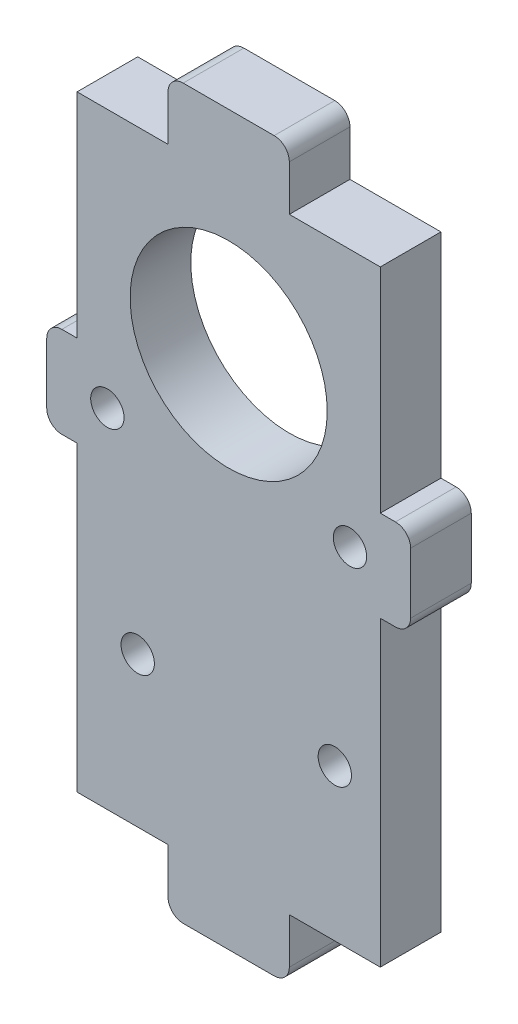
ISO-10303-21;
HEADER;
FILE_DESCRIPTION(('STEP AP214'),'2;1');
FILE_NAME('part.step','',(''),(''),'','','');
FILE_SCHEMA(('AUTOMOTIVE_DESIGN { 1 0 10303 214 1 1 1 1 }'));
ENDSEC;
DATA;
#1=APPLICATION_CONTEXT('core data for automotive mechanical design processes');
#2=APPLICATION_PROTOCOL_DEFINITION('international standard','automotive_design',2000,#1);
#3=PRODUCT_CONTEXT('',#1,'mechanical');
#4=PRODUCT('Part','Part','',(#3));
#5=PRODUCT_RELATED_PRODUCT_CATEGORY('part','',(#4));
#6=PRODUCT_DEFINITION_FORMATION('','',#4);
#7=PRODUCT_DEFINITION_CONTEXT('part definition',#1,'design');
#8=PRODUCT_DEFINITION('design','',#6,#7);
#9=PRODUCT_DEFINITION_SHAPE('','',#8);
#10=(LENGTH_UNIT() NAMED_UNIT(*) SI_UNIT(.MILLI.,.METRE.));
#11=(NAMED_UNIT(*) PLANE_ANGLE_UNIT() SI_UNIT($,.RADIAN.));
#12=(NAMED_UNIT(*) SI_UNIT($,.STERADIAN.) SOLID_ANGLE_UNIT());
#13=UNCERTAINTY_MEASURE_WITH_UNIT(LENGTH_MEASURE(1.E-05),#10,'distance_accuracy_value','');
#14=(GEOMETRIC_REPRESENTATION_CONTEXT(3) GLOBAL_UNCERTAINTY_ASSIGNED_CONTEXT((#13)) GLOBAL_UNIT_ASSIGNED_CONTEXT((#10,
#11,#12)) REPRESENTATION_CONTEXT('',''));
#15=CARTESIAN_POINT('',(0.,0.,0.));
#16=DIRECTION('',(0.,0.,1.));
#17=DIRECTION('',(1.,0.,0.));
#18=AXIS2_PLACEMENT_3D('',#15,#16,#17);
#19=CARTESIAN_POINT('',(9.99999999999999,0.,4.));
#20=DIRECTION('',(1.,0.,0.));
#21=DIRECTION('',(0.,1.,0.));
#22=AXIS2_PLACEMENT_3D('',#19,#20,#21);
#23=PLANE('',#22);
#24=DIRECTION('',(0.,-1.,0.));
#25=VECTOR('',#24,1.);
#26=CARTESIAN_POINT('',(9.99999999999999,0.,0.));
#27=LINE('',#26,#25);
#28=CARTESIAN_POINT('',(9.99999999999999,20.,0.));
#29=VERTEX_POINT('',#28);
#30=CARTESIAN_POINT('',(9.99999999999999,5.9336621800509,0.));
#31=VERTEX_POINT('',#30);
#32=EDGE_CURVE('E264',#29,#31,#27,.T.);
#33=ORIENTED_EDGE('',*,*,#32,.F.);
#34=DIRECTION('',(0.,0.,-1.));
#35=VECTOR('',#34,1.);
#36=CARTESIAN_POINT('',(9.99999999999999,20.,4.));
#37=LINE('',#36,#35);
#38=CARTESIAN_POINT('',(9.99999999999999,20.,4.));
#39=VERTEX_POINT('',#38);
#40=EDGE_CURVE('E11',#39,#29,#37,.T.);
#41=ORIENTED_EDGE('',*,*,#40,.F.);
#42=DIRECTION('',(0.,-1.,0.));
#43=VECTOR('',#42,1.);
#44=CARTESIAN_POINT('',(9.99999999999999,0.,4.));
#45=LINE('',#44,#43);
#46=CARTESIAN_POINT('',(9.99999999999999,5.9336621800509,4.));
#47=VERTEX_POINT('',#46);
#48=EDGE_CURVE('E575',#39,#47,#45,.T.);
#49=ORIENTED_EDGE('',*,*,#48,.T.);
#50=DIRECTION('',(0.,0.,-1.));
#51=VECTOR('',#50,1.);
#52=CARTESIAN_POINT('',(9.99999999999999,5.9336621800509,4.));
#53=LINE('',#52,#51);
#54=EDGE_CURVE('E53',#47,#31,#53,.T.);
#55=ORIENTED_EDGE('',*,*,#54,.T.);
#56=EDGE_LOOP('',(#33,#41,#49,#55));
#57=FACE_BOUND('',#56,.T.);
#58=ADVANCED_FACE('F36',(#57),#23,.T.);
#59=CARTESIAN_POINT('',(0.,20.,4.));
#60=DIRECTION('',(0.,1.,0.));
#61=DIRECTION('',(-1.,0.,0.));
#62=AXIS2_PLACEMENT_3D('',#59,#60,#61);
#63=PLANE('',#62);
#64=DIRECTION('',(1.,0.,0.));
#65=VECTOR('',#64,1.);
#66=CARTESIAN_POINT('',(0.,20.,0.));
#67=LINE('',#66,#65);
#68=CARTESIAN_POINT('',(4.,20.,0.));
#69=VERTEX_POINT('',#68);
#70=EDGE_CURVE('E266',#69,#29,#67,.T.);
#71=ORIENTED_EDGE('',*,*,#70,.F.);
#72=DIRECTION('',(0.,0.,-1.));
#73=VECTOR('',#72,1.);
#74=CARTESIAN_POINT('',(4.,20.,4.));
#75=LINE('',#74,#73);
#76=CARTESIAN_POINT('',(4.,20.,4.));
#77=VERTEX_POINT('',#76);
#78=EDGE_CURVE('E45',#77,#69,#75,.T.);
#79=ORIENTED_EDGE('',*,*,#78,.F.);
#80=DIRECTION('',(1.,0.,0.));
#81=VECTOR('',#80,1.);
#82=CARTESIAN_POINT('',(0.,20.,4.));
#83=LINE('',#82,#81);
#84=EDGE_CURVE('E406',#77,#39,#83,.T.);
#85=ORIENTED_EDGE('',*,*,#84,.T.);
#86=ORIENTED_EDGE('',*,*,#40,.T.);
#87=EDGE_LOOP('',(#71,#79,#85,#86));
#88=FACE_BOUND('',#87,.T.);
#89=ADVANCED_FACE('F405',(#88),#63,.T.);
#90=CARTESIAN_POINT('',(4.,0.,4.));
#91=DIRECTION('',(-1.,0.,0.));
#92=DIRECTION('',(0.,0.,1.));
#93=AXIS2_PLACEMENT_3D('',#90,#91,#92);
#94=PLANE('',#93);
#95=DIRECTION('',(0.,1.,0.));
#96=VECTOR('',#95,1.);
#97=CARTESIAN_POINT('',(4.,0.,0.));
#98=LINE('',#97,#96);
#99=CARTESIAN_POINT('',(4.,23.,0.));
#100=VERTEX_POINT('',#99);
#101=EDGE_CURVE('E270',#69,#100,#98,.T.);
#102=ORIENTED_EDGE('',*,*,#101,.T.);
#103=DIRECTION('',(0.,0.,-1.));
#104=VECTOR('',#103,1.);
#105=CARTESIAN_POINT('',(4.,23.,4.));
#106=LINE('',#105,#104);
#107=CARTESIAN_POINT('',(4.,23.,4.));
#108=VERTEX_POINT('',#107);
#109=EDGE_CURVE('E391',#108,#100,#106,.T.);
#110=ORIENTED_EDGE('',*,*,#109,.F.);
#111=DIRECTION('',(0.,1.,0.));
#112=VECTOR('',#111,1.);
#113=CARTESIAN_POINT('',(4.,0.,4.));
#114=LINE('',#113,#112);
#115=EDGE_CURVE('E397',#77,#108,#114,.T.);
#116=ORIENTED_EDGE('',*,*,#115,.F.);
#117=ORIENTED_EDGE('',*,*,#78,.T.);
#118=EDGE_LOOP('',(#102,#110,#116,#117));
#119=FACE_BOUND('',#118,.T.);
#120=ADVANCED_FACE('F395',(#119),#94,.F.);
#121=CARTESIAN_POINT('',(3.,23.,4.));
#122=DIRECTION('',(0.,0.,-1.));
#123=DIRECTION('',(-1.,0.,0.));
#124=AXIS2_PLACEMENT_3D('',#121,#122,#123);
#125=CYLINDRICAL_SURFACE('',#124,1.);
#126=CARTESIAN_POINT('',(3.,23.,0.));
#127=DIRECTION('',(0.,0.,1.));
#128=DIRECTION('',(1.,0.,0.));
#129=AXIS2_PLACEMENT_3D('',#126,#127,#128);
#130=CIRCLE('',#129,1.);
#131=CARTESIAN_POINT('',(3.,24.,0.));
#132=VERTEX_POINT('',#131);
#133=EDGE_CURVE('E274',#132,#100,#130,.F.);
#134=ORIENTED_EDGE('',*,*,#133,.F.);
#135=DIRECTION('',(0.,0.,-1.));
#136=VECTOR('',#135,1.);
#137=CARTESIAN_POINT('',(3.,24.,4.));
#138=LINE('',#137,#136);
#139=CARTESIAN_POINT('',(3.,24.,4.));
#140=VERTEX_POINT('',#139);
#141=EDGE_CURVE('E389',#140,#132,#138,.T.);
#142=ORIENTED_EDGE('',*,*,#141,.F.);
#143=CARTESIAN_POINT('',(3.,23.,4.));
#144=DIRECTION('',(0.,0.,1.));
#145=DIRECTION('',(1.,0.,0.));
#146=AXIS2_PLACEMENT_3D('',#143,#144,#145);
#147=CIRCLE('',#146,1.);
#148=EDGE_CURVE('E546',#140,#108,#147,.F.);
#149=ORIENTED_EDGE('',*,*,#148,.T.);
#150=ORIENTED_EDGE('',*,*,#109,.T.);
#151=EDGE_LOOP('',(#134,#142,#149,#150));
#152=FACE_BOUND('',#151,.T.);
#153=ADVANCED_FACE('F545',(#152),#125,.T.);
#154=CARTESIAN_POINT('',(0.,24.,4.));
#155=DIRECTION('',(0.,1.,0.));
#156=DIRECTION('',(0.,0.,1.));
#157=AXIS2_PLACEMENT_3D('',#154,#155,#156);
#158=PLANE('',#157);
#159=DIRECTION('',(1.,0.,0.));
#160=VECTOR('',#159,1.);
#161=CARTESIAN_POINT('',(0.,24.,0.));
#162=LINE('',#161,#160);
#163=CARTESIAN_POINT('',(-3.,24.,0.));
#164=VERTEX_POINT('',#163);
#165=EDGE_CURVE('E277',#164,#132,#162,.T.);
#166=ORIENTED_EDGE('',*,*,#165,.F.);
#167=DIRECTION('',(0.,0.,-1.));
#168=VECTOR('',#167,1.);
#169=CARTESIAN_POINT('',(-3.,24.,4.));
#170=LINE('',#169,#168);
#171=CARTESIAN_POINT('',(-3.,24.,4.));
#172=VERTEX_POINT('',#171);
#173=EDGE_CURVE('E387',#172,#164,#170,.T.);
#174=ORIENTED_EDGE('',*,*,#173,.F.);
#175=DIRECTION('',(1.,0.,0.));
#176=VECTOR('',#175,1.);
#177=CARTESIAN_POINT('',(0.,24.,4.));
#178=LINE('',#177,#176);
#179=EDGE_CURVE('E541',#172,#140,#178,.T.);
#180=ORIENTED_EDGE('',*,*,#179,.T.);
#181=ORIENTED_EDGE('',*,*,#141,.T.);
#182=EDGE_LOOP('',(#166,#174,#180,#181));
#183=FACE_BOUND('',#182,.T.);
#184=ADVANCED_FACE('F540',(#183),#158,.T.);
#185=CARTESIAN_POINT('',(-3.,23.,4.));
#186=DIRECTION('',(0.,0.,-1.));
#187=DIRECTION('',(-1.,0.,0.));
#188=AXIS2_PLACEMENT_3D('',#185,#186,#187);
#189=CYLINDRICAL_SURFACE('',#188,1.);
#190=CARTESIAN_POINT('',(-3.,23.,0.));
#191=DIRECTION('',(0.,0.,1.));
#192=DIRECTION('',(1.,0.,0.));
#193=AXIS2_PLACEMENT_3D('',#190,#191,#192);
#194=CIRCLE('',#193,1.);
#195=CARTESIAN_POINT('',(-4.,23.,0.));
#196=VERTEX_POINT('',#195);
#197=EDGE_CURVE('E280',#196,#164,#194,.F.);
#198=ORIENTED_EDGE('',*,*,#197,.F.);
#199=DIRECTION('',(0.,0.,-1.));
#200=VECTOR('',#199,1.);
#201=CARTESIAN_POINT('',(-4.,23.,4.));
#202=LINE('',#201,#200);
#203=CARTESIAN_POINT('',(-4.,23.,4.));
#204=VERTEX_POINT('',#203);
#205=EDGE_CURVE('E385',#204,#196,#202,.T.);
#206=ORIENTED_EDGE('',*,*,#205,.F.);
#207=CARTESIAN_POINT('',(-3.,23.,4.));
#208=DIRECTION('',(0.,0.,1.));
#209=DIRECTION('',(1.,0.,0.));
#210=AXIS2_PLACEMENT_3D('',#207,#208,#209);
#211=CIRCLE('',#210,1.);
#212=EDGE_CURVE('E536',#204,#172,#211,.F.);
#213=ORIENTED_EDGE('',*,*,#212,.T.);
#214=ORIENTED_EDGE('',*,*,#173,.T.);
#215=EDGE_LOOP('',(#198,#206,#213,#214));
#216=FACE_BOUND('',#215,.T.);
#217=ADVANCED_FACE('F534',(#216),#189,.T.);
#218=CARTESIAN_POINT('',(-4.,0.,4.));
#219=DIRECTION('',(-1.,0.,0.));
#220=DIRECTION('',(0.,0.,1.));
#221=AXIS2_PLACEMENT_3D('',#218,#219,#220);
#222=PLANE('',#221);
#223=DIRECTION('',(0.,1.,0.));
#224=VECTOR('',#223,1.);
#225=CARTESIAN_POINT('',(-4.,0.,0.));
#226=LINE('',#225,#224);
#227=CARTESIAN_POINT('',(-4.,20.,0.));
#228=VERTEX_POINT('',#227);
#229=EDGE_CURVE('E283',#228,#196,#226,.T.);
#230=ORIENTED_EDGE('',*,*,#229,.F.);
#231=DIRECTION('',(0.,0.,-1.));
#232=VECTOR('',#231,1.);
#233=CARTESIAN_POINT('',(-4.,20.,4.));
#234=LINE('',#233,#232);
#235=CARTESIAN_POINT('',(-4.,20.,4.));
#236=VERTEX_POINT('',#235);
#237=EDGE_CURVE('E383',#236,#228,#234,.T.);
#238=ORIENTED_EDGE('',*,*,#237,.F.);
#239=DIRECTION('',(0.,1.,0.));
#240=VECTOR('',#239,1.);
#241=CARTESIAN_POINT('',(-4.,0.,4.));
#242=LINE('',#241,#240);
#243=EDGE_CURVE('E530',#236,#204,#242,.T.);
#244=ORIENTED_EDGE('',*,*,#243,.T.);
#245=ORIENTED_EDGE('',*,*,#205,.T.);
#246=EDGE_LOOP('',(#230,#238,#244,#245));
#247=FACE_BOUND('',#246,.T.);
#248=ADVANCED_FACE('F527',(#247),#222,.T.);
#249=CARTESIAN_POINT('',(-10.,20.,0.));
#250=VERTEX_POINT('',#249);
#251=EDGE_CURVE('E271',#250,#228,#67,.T.);
#252=ORIENTED_EDGE('',*,*,#251,.F.);
#253=DIRECTION('',(0.,0.,-1.));
#254=VECTOR('',#253,1.);
#255=CARTESIAN_POINT('',(-10.,20.,4.));
#256=LINE('',#255,#254);
#257=CARTESIAN_POINT('',(-10.,20.,4.));
#258=VERTEX_POINT('',#257);
#259=EDGE_CURVE('E381',#258,#250,#256,.T.);
#260=ORIENTED_EDGE('',*,*,#259,.F.);
#261=EDGE_CURVE('E523',#258,#236,#83,.T.);
#262=ORIENTED_EDGE('',*,*,#261,.T.);
#263=ORIENTED_EDGE('',*,*,#237,.T.);
#264=EDGE_LOOP('',(#252,#260,#262,#263));
#265=FACE_BOUND('',#264,.T.);
#266=ADVANCED_FACE('F427',(#265),#63,.T.);
#267=CARTESIAN_POINT('',(-10.,0.,4.));
#268=DIRECTION('',(1.,0.,0.));
#269=DIRECTION('',(0.,1.,0.));
#270=AXIS2_PLACEMENT_3D('',#267,#268,#269);
#271=PLANE('',#270);
#272=DIRECTION('',(0.,-1.,0.));
#273=VECTOR('',#272,1.);
#274=CARTESIAN_POINT('',(-10.,0.,0.));
#275=LINE('',#274,#273);
#276=CARTESIAN_POINT('',(-10.,5.9336621800509,0.));
#277=VERTEX_POINT('',#276);
#278=EDGE_CURVE('E286',#250,#277,#275,.T.);
#279=ORIENTED_EDGE('',*,*,#278,.T.);
#280=DIRECTION('',(0.,0.,-1.));
#281=VECTOR('',#280,1.);
#282=CARTESIAN_POINT('',(-10.,5.9336621800509,4.));
#283=LINE('',#282,#281);
#284=CARTESIAN_POINT('',(-10.,5.9336621800509,4.));
#285=VERTEX_POINT('',#284);
#286=EDGE_CURVE('E378',#285,#277,#283,.T.);
#287=ORIENTED_EDGE('',*,*,#286,.F.);
#288=DIRECTION('',(0.,-1.,0.));
#289=VECTOR('',#288,1.);
#290=CARTESIAN_POINT('',(-10.,0.,4.));
#291=LINE('',#290,#289);
#292=EDGE_CURVE('E519',#258,#285,#291,.T.);
#293=ORIENTED_EDGE('',*,*,#292,.F.);
#294=ORIENTED_EDGE('',*,*,#259,.T.);
#295=EDGE_LOOP('',(#279,#287,#293,#294));
#296=FACE_BOUND('',#295,.T.);
#297=ADVANCED_FACE('F518',(#296),#271,.F.);
#298=CARTESIAN_POINT('',(0.,5.93366218005089,4.));
#299=DIRECTION('',(0.,-1.,0.));
#300=DIRECTION('',(1.,0.,0.));
#301=AXIS2_PLACEMENT_3D('',#298,#299,#300);
#302=PLANE('',#301);
#303=DIRECTION('',(-1.,0.,0.));
#304=VECTOR('',#303,1.);
#305=CARTESIAN_POINT('',(0.,5.93366218005089,0.));
#306=LINE('',#305,#304);
#307=CARTESIAN_POINT('',(-11.,5.93366218005091,0.));
#308=VERTEX_POINT('',#307);
#309=EDGE_CURVE('E289',#277,#308,#306,.T.);
#310=ORIENTED_EDGE('',*,*,#309,.T.);
#311=DIRECTION('',(0.,0.,-1.));
#312=VECTOR('',#311,1.);
#313=CARTESIAN_POINT('',(-11.,5.93366218005091,4.));
#314=LINE('',#313,#312);
#315=CARTESIAN_POINT('',(-11.,5.93366218005091,4.));
#316=VERTEX_POINT('',#315);
#317=EDGE_CURVE('E375',#316,#308,#314,.T.);
#318=ORIENTED_EDGE('',*,*,#317,.F.);
#319=DIRECTION('',(-1.,0.,0.));
#320=VECTOR('',#319,1.);
#321=CARTESIAN_POINT('',(0.,5.93366218005089,4.));
#322=LINE('',#321,#320);
#323=EDGE_CURVE('E514',#285,#316,#322,.T.);
#324=ORIENTED_EDGE('',*,*,#323,.F.);
#325=ORIENTED_EDGE('',*,*,#286,.T.);
#326=EDGE_LOOP('',(#310,#318,#324,#325));
#327=FACE_BOUND('',#326,.T.);
#328=ADVANCED_FACE('F512',(#327),#302,.F.);
#329=CARTESIAN_POINT('',(-11.,4.93366218005091,4.));
#330=DIRECTION('',(0.,0.,-1.));
#331=DIRECTION('',(-1.,0.,0.));
#332=AXIS2_PLACEMENT_3D('',#329,#330,#331);
#333=CYLINDRICAL_SURFACE('',#332,1.);
#334=CARTESIAN_POINT('',(-11.,4.93366218005091,0.));
#335=DIRECTION('',(0.,0.,1.));
#336=DIRECTION('',(1.,0.,0.));
#337=AXIS2_PLACEMENT_3D('',#334,#335,#336);
#338=CIRCLE('',#337,1.);
#339=CARTESIAN_POINT('',(-12.,4.93366218005091,0.));
#340=VERTEX_POINT('',#339);
#341=EDGE_CURVE('E293',#308,#340,#338,.T.);
#342=ORIENTED_EDGE('',*,*,#341,.T.);
#343=DIRECTION('',(0.,0.,-1.));
#344=VECTOR('',#343,1.);
#345=CARTESIAN_POINT('',(-12.,4.93366218005091,4.));
#346=LINE('',#345,#344);
#347=CARTESIAN_POINT('',(-12.,4.93366218005091,4.));
#348=VERTEX_POINT('',#347);
#349=EDGE_CURVE('E372',#348,#340,#346,.T.);
#350=ORIENTED_EDGE('',*,*,#349,.F.);
#351=CARTESIAN_POINT('',(-11.,4.93366218005091,4.));
#352=DIRECTION('',(0.,0.,1.));
#353=DIRECTION('',(1.,0.,0.));
#354=AXIS2_PLACEMENT_3D('',#351,#352,#353);
#355=CIRCLE('',#354,1.);
#356=EDGE_CURVE('E556',#316,#348,#355,.T.);
#357=ORIENTED_EDGE('',*,*,#356,.F.);
#358=ORIENTED_EDGE('',*,*,#317,.T.);
#359=EDGE_LOOP('',(#342,#350,#357,#358));
#360=FACE_BOUND('',#359,.T.);
#361=ADVANCED_FACE('F505',(#360),#333,.T.);
#362=CARTESIAN_POINT('',(-12.,0.,4.));
#363=DIRECTION('',(1.,0.,0.));
#364=DIRECTION('',(0.,0.,-1.));
#365=AXIS2_PLACEMENT_3D('',#362,#363,#364);
#366=PLANE('',#365);
#367=DIRECTION('',(0.,-1.,0.));
#368=VECTOR('',#367,1.);
#369=CARTESIAN_POINT('',(-12.,0.,0.));
#370=LINE('',#369,#368);
#371=CARTESIAN_POINT('',(-12.,0.933662180050906,0.));
#372=VERTEX_POINT('',#371);
#373=EDGE_CURVE('E296',#340,#372,#370,.T.);
#374=ORIENTED_EDGE('',*,*,#373,.T.);
#375=DIRECTION('',(0.,0.,-1.));
#376=VECTOR('',#375,1.);
#377=CARTESIAN_POINT('',(-12.,0.933662180050906,4.));
#378=LINE('',#377,#376);
#379=CARTESIAN_POINT('',(-12.,0.933662180050906,4.));
#380=VERTEX_POINT('',#379);
#381=EDGE_CURVE('E370',#380,#372,#378,.T.);
#382=ORIENTED_EDGE('',*,*,#381,.F.);
#383=DIRECTION('',(0.,-1.,0.));
#384=VECTOR('',#383,1.);
#385=CARTESIAN_POINT('',(-12.,0.,4.));
#386=LINE('',#385,#384);
#387=EDGE_CURVE('E502',#348,#380,#386,.T.);
#388=ORIENTED_EDGE('',*,*,#387,.F.);
#389=ORIENTED_EDGE('',*,*,#349,.T.);
#390=EDGE_LOOP('',(#374,#382,#388,#389));
#391=FACE_BOUND('',#390,.T.);
#392=ADVANCED_FACE('F500',(#391),#366,.F.);
#393=CARTESIAN_POINT('',(-11.,0.933662180050906,4.));
#394=DIRECTION('',(0.,0.,-1.));
#395=DIRECTION('',(-1.,0.,0.));
#396=AXIS2_PLACEMENT_3D('',#393,#394,#395);
#397=CYLINDRICAL_SURFACE('',#396,1.);
#398=CARTESIAN_POINT('',(-11.,0.933662180050906,0.));
#399=DIRECTION('',(0.,0.,1.));
#400=DIRECTION('',(1.,0.,0.));
#401=AXIS2_PLACEMENT_3D('',#398,#399,#400);
#402=CIRCLE('',#401,1.);
#403=CARTESIAN_POINT('',(-11.,-0.0663378199490941,0.));
#404=VERTEX_POINT('',#403);
#405=EDGE_CURVE('E299',#404,#372,#402,.F.);
#406=ORIENTED_EDGE('',*,*,#405,.F.);
#407=DIRECTION('',(0.,0.,-1.));
#408=VECTOR('',#407,1.);
#409=CARTESIAN_POINT('',(-11.,-0.0663378199490941,4.));
#410=LINE('',#409,#408);
#411=CARTESIAN_POINT('',(-11.,-0.0663378199490941,4.));
#412=VERTEX_POINT('',#411);
#413=EDGE_CURVE('E368',#412,#404,#410,.T.);
#414=ORIENTED_EDGE('',*,*,#413,.F.);
#415=CARTESIAN_POINT('',(-11.,0.933662180050906,4.));
#416=DIRECTION('',(0.,0.,1.));
#417=DIRECTION('',(1.,0.,0.));
#418=AXIS2_PLACEMENT_3D('',#415,#416,#417);
#419=CIRCLE('',#418,1.);
#420=EDGE_CURVE('E498',#412,#380,#419,.F.);
#421=ORIENTED_EDGE('',*,*,#420,.T.);
#422=ORIENTED_EDGE('',*,*,#381,.T.);
#423=EDGE_LOOP('',(#406,#414,#421,#422));
#424=FACE_BOUND('',#423,.T.);
#425=ADVANCED_FACE('F494',(#424),#397,.T.);
#426=CARTESIAN_POINT('',(0.,-0.0663378199490908,4.));
#427=DIRECTION('',(0.,-1.,0.));
#428=DIRECTION('',(1.,0.,0.));
#429=AXIS2_PLACEMENT_3D('',#426,#427,#428);
#430=PLANE('',#429);
#431=DIRECTION('',(-1.,0.,0.));
#432=VECTOR('',#431,1.);
#433=CARTESIAN_POINT('',(0.,-0.0663378199490908,0.));
#434=LINE('',#433,#432);
#435=CARTESIAN_POINT('',(-10.,-0.0663378199490938,0.));
#436=VERTEX_POINT('',#435);
#437=EDGE_CURVE('E302',#436,#404,#434,.T.);
#438=ORIENTED_EDGE('',*,*,#437,.F.);
#439=DIRECTION('',(0.,0.,-1.));
#440=VECTOR('',#439,1.);
#441=CARTESIAN_POINT('',(-10.,-0.0663378199490938,4.));
#442=LINE('',#441,#440);
#443=CARTESIAN_POINT('',(-10.,-0.0663378199490938,4.));
#444=VERTEX_POINT('',#443);
#445=EDGE_CURVE('E366',#444,#436,#442,.T.);
#446=ORIENTED_EDGE('',*,*,#445,.F.);
#447=DIRECTION('',(-1.,0.,0.));
#448=VECTOR('',#447,1.);
#449=CARTESIAN_POINT('',(0.,-0.0663378199490908,4.));
#450=LINE('',#449,#448);
#451=EDGE_CURVE('E491',#444,#412,#450,.T.);
#452=ORIENTED_EDGE('',*,*,#451,.T.);
#453=ORIENTED_EDGE('',*,*,#413,.T.);
#454=EDGE_LOOP('',(#438,#446,#452,#453));
#455=FACE_BOUND('',#454,.T.);
#456=ADVANCED_FACE('F490',(#455),#430,.T.);
#457=CARTESIAN_POINT('',(-9.99999999999999,-20.,0.));
#458=VERTEX_POINT('',#457);
#459=EDGE_CURVE('E290',#436,#458,#275,.T.);
#460=ORIENTED_EDGE('',*,*,#459,.T.);
#461=DIRECTION('',(0.,0.,-1.));
#462=VECTOR('',#461,1.);
#463=CARTESIAN_POINT('',(-9.99999999999999,-20.,4.));
#464=LINE('',#463,#462);
#465=CARTESIAN_POINT('',(-9.99999999999999,-20.,4.));
#466=VERTEX_POINT('',#465);
#467=EDGE_CURVE('E363',#466,#458,#464,.T.);
#468=ORIENTED_EDGE('',*,*,#467,.F.);
#469=EDGE_CURVE('E486',#444,#466,#291,.T.);
#470=ORIENTED_EDGE('',*,*,#469,.F.);
#471=ORIENTED_EDGE('',*,*,#445,.T.);
#472=EDGE_LOOP('',(#460,#468,#470,#471));
#473=FACE_BOUND('',#472,.T.);
#474=ADVANCED_FACE('F485',(#473),#271,.F.);
#475=CARTESIAN_POINT('',(0.,-20.,4.));
#476=DIRECTION('',(0.,1.,0.));
#477=DIRECTION('',(-1.,0.,0.));
#478=AXIS2_PLACEMENT_3D('',#475,#476,#477);
#479=PLANE('',#478);
#480=DIRECTION('',(1.,0.,0.));
#481=VECTOR('',#480,1.);
#482=CARTESIAN_POINT('',(0.,-20.,0.));
#483=LINE('',#482,#481);
#484=CARTESIAN_POINT('',(-3.99999999999999,-20.,0.));
#485=VERTEX_POINT('',#484);
#486=EDGE_CURVE('E305',#458,#485,#483,.T.);
#487=ORIENTED_EDGE('',*,*,#486,.T.);
#488=DIRECTION('',(0.,0.,-1.));
#489=VECTOR('',#488,1.);
#490=CARTESIAN_POINT('',(-3.99999999999999,-20.,4.));
#491=LINE('',#490,#489);
#492=CARTESIAN_POINT('',(-3.99999999999999,-20.,4.));
#493=VERTEX_POINT('',#492);
#494=EDGE_CURVE('E360',#493,#485,#491,.T.);
#495=ORIENTED_EDGE('',*,*,#494,.F.);
#496=DIRECTION('',(1.,0.,0.));
#497=VECTOR('',#496,1.);
#498=CARTESIAN_POINT('',(0.,-20.,4.));
#499=LINE('',#498,#497);
#500=EDGE_CURVE('E481',#466,#493,#499,.T.);
#501=ORIENTED_EDGE('',*,*,#500,.F.);
#502=ORIENTED_EDGE('',*,*,#467,.T.);
#503=EDGE_LOOP('',(#487,#495,#501,#502));
#504=FACE_BOUND('',#503,.T.);
#505=ADVANCED_FACE('F442',(#504),#479,.F.);
#506=CARTESIAN_POINT('',(-3.99999999999999,0.,4.));
#507=DIRECTION('',(1.,0.,0.));
#508=DIRECTION('',(0.,0.,-1.));
#509=AXIS2_PLACEMENT_3D('',#506,#507,#508);
#510=PLANE('',#509);
#511=DIRECTION('',(0.,-1.,0.));
#512=VECTOR('',#511,1.);
#513=CARTESIAN_POINT('',(-3.99999999999999,0.,0.));
#514=LINE('',#513,#512);
#515=CARTESIAN_POINT('',(-3.99999999999999,-23.,0.));
#516=VERTEX_POINT('',#515);
#517=EDGE_CURVE('E308',#485,#516,#514,.T.);
#518=ORIENTED_EDGE('',*,*,#517,.T.);
#519=DIRECTION('',(0.,0.,-1.));
#520=VECTOR('',#519,1.);
#521=CARTESIAN_POINT('',(-3.99999999999999,-23.,4.));
#522=LINE('',#521,#520);
#523=CARTESIAN_POINT('',(-3.99999999999999,-23.,4.));
#524=VERTEX_POINT('',#523);
#525=EDGE_CURVE('E357',#524,#516,#522,.T.);
#526=ORIENTED_EDGE('',*,*,#525,.F.);
#527=DIRECTION('',(0.,-1.,0.));
#528=VECTOR('',#527,1.);
#529=CARTESIAN_POINT('',(-3.99999999999999,0.,4.));
#530=LINE('',#529,#528);
#531=EDGE_CURVE('E562',#493,#524,#530,.T.);
#532=ORIENTED_EDGE('',*,*,#531,.F.);
#533=ORIENTED_EDGE('',*,*,#494,.T.);
#534=EDGE_LOOP('',(#518,#526,#532,#533));
#535=FACE_BOUND('',#534,.T.);
#536=ADVANCED_FACE('F473',(#535),#510,.F.);
#537=CARTESIAN_POINT('',(-2.99999999999999,-23.,4.));
#538=DIRECTION('',(0.,0.,-1.));
#539=DIRECTION('',(-1.,0.,0.));
#540=AXIS2_PLACEMENT_3D('',#537,#538,#539);
#541=CYLINDRICAL_SURFACE('',#540,1.);
#542=CARTESIAN_POINT('',(-2.99999999999999,-23.,0.));
#543=DIRECTION('',(0.,0.,1.));
#544=DIRECTION('',(1.,0.,0.));
#545=AXIS2_PLACEMENT_3D('',#542,#543,#544);
#546=CIRCLE('',#545,1.);
#547=CARTESIAN_POINT('',(-2.99999999999999,-24.,0.));
#548=VERTEX_POINT('',#547);
#549=EDGE_CURVE('E312',#516,#548,#546,.T.);
#550=ORIENTED_EDGE('',*,*,#549,.T.);
#551=DIRECTION('',(0.,0.,-1.));
#552=VECTOR('',#551,1.);
#553=CARTESIAN_POINT('',(-2.99999999999999,-24.,4.));
#554=LINE('',#553,#552);
#555=CARTESIAN_POINT('',(-2.99999999999999,-24.,4.));
#556=VERTEX_POINT('',#555);
#557=EDGE_CURVE('E354',#556,#548,#554,.T.);
#558=ORIENTED_EDGE('',*,*,#557,.F.);
#559=CARTESIAN_POINT('',(-2.99999999999999,-23.,4.));
#560=DIRECTION('',(0.,0.,1.));
#561=DIRECTION('',(1.,0.,0.));
#562=AXIS2_PLACEMENT_3D('',#559,#560,#561);
#563=CIRCLE('',#562,1.);
#564=EDGE_CURVE('E470',#524,#556,#563,.T.);
#565=ORIENTED_EDGE('',*,*,#564,.F.);
#566=ORIENTED_EDGE('',*,*,#525,.T.);
#567=EDGE_LOOP('',(#550,#558,#565,#566));
#568=FACE_BOUND('',#567,.T.);
#569=ADVANCED_FACE('F468',(#568),#541,.T.);
#570=CARTESIAN_POINT('',(0.,-24.,4.));
#571=DIRECTION('',(0.,1.,0.));
#572=DIRECTION('',(0.,0.,1.));
#573=AXIS2_PLACEMENT_3D('',#570,#571,#572);
#574=PLANE('',#573);
#575=DIRECTION('',(1.,0.,0.));
#576=VECTOR('',#575,1.);
#577=CARTESIAN_POINT('',(0.,-24.,0.));
#578=LINE('',#577,#576);
#579=CARTESIAN_POINT('',(3.00000000000001,-24.,0.));
#580=VERTEX_POINT('',#579);
#581=EDGE_CURVE('E315',#548,#580,#578,.T.);
#582=ORIENTED_EDGE('',*,*,#581,.T.);
#583=DIRECTION('',(0.,0.,-1.));
#584=VECTOR('',#583,1.);
#585=CARTESIAN_POINT('',(3.00000000000001,-24.,4.));
#586=LINE('',#585,#584);
#587=CARTESIAN_POINT('',(3.00000000000001,-24.,4.));
#588=VERTEX_POINT('',#587);
#589=EDGE_CURVE('E351',#588,#580,#586,.T.);
#590=ORIENTED_EDGE('',*,*,#589,.F.);
#591=DIRECTION('',(1.,0.,0.));
#592=VECTOR('',#591,1.);
#593=CARTESIAN_POINT('',(0.,-24.,4.));
#594=LINE('',#593,#592);
#595=EDGE_CURVE('E465',#556,#588,#594,.T.);
#596=ORIENTED_EDGE('',*,*,#595,.F.);
#597=ORIENTED_EDGE('',*,*,#557,.T.);
#598=EDGE_LOOP('',(#582,#590,#596,#597));
#599=FACE_BOUND('',#598,.T.);
#600=ADVANCED_FACE('F463',(#599),#574,.F.);
#601=CARTESIAN_POINT('',(3.00000000000001,-23.,4.));
#602=DIRECTION('',(0.,0.,-1.));
#603=DIRECTION('',(-1.,0.,0.));
#604=AXIS2_PLACEMENT_3D('',#601,#602,#603);
#605=CYLINDRICAL_SURFACE('',#604,1.);
#606=CARTESIAN_POINT('',(3.00000000000001,-23.,0.));
#607=DIRECTION('',(0.,0.,1.));
#608=DIRECTION('',(1.,0.,0.));
#609=AXIS2_PLACEMENT_3D('',#606,#607,#608);
#610=CIRCLE('',#609,1.);
#611=CARTESIAN_POINT('',(4.00000000000001,-23.,0.));
#612=VERTEX_POINT('',#611);
#613=EDGE_CURVE('E318',#580,#612,#610,.T.);
#614=ORIENTED_EDGE('',*,*,#613,.T.);
#615=DIRECTION('',(0.,0.,-1.));
#616=VECTOR('',#615,1.);
#617=CARTESIAN_POINT('',(4.00000000000001,-23.,4.));
#618=LINE('',#617,#616);
#619=CARTESIAN_POINT('',(4.00000000000001,-23.,4.));
#620=VERTEX_POINT('',#619);
#621=EDGE_CURVE('E349',#620,#612,#618,.T.);
#622=ORIENTED_EDGE('',*,*,#621,.F.);
#623=CARTESIAN_POINT('',(3.00000000000001,-23.,4.));
#624=DIRECTION('',(0.,0.,1.));
#625=DIRECTION('',(1.,0.,0.));
#626=AXIS2_PLACEMENT_3D('',#623,#624,#625);
#627=CIRCLE('',#626,1.);
#628=EDGE_CURVE('E567',#588,#620,#627,.T.);
#629=ORIENTED_EDGE('',*,*,#628,.F.);
#630=ORIENTED_EDGE('',*,*,#589,.T.);
#631=EDGE_LOOP('',(#614,#622,#629,#630));
#632=FACE_BOUND('',#631,.T.);
#633=ADVANCED_FACE('F459',(#632),#605,.T.);
#634=CARTESIAN_POINT('',(4.00000000000001,0.,4.));
#635=DIRECTION('',(1.,0.,0.));
#636=DIRECTION('',(0.,0.,-1.));
#637=AXIS2_PLACEMENT_3D('',#634,#635,#636);
#638=PLANE('',#637);
#639=DIRECTION('',(0.,-1.,0.));
#640=VECTOR('',#639,1.);
#641=CARTESIAN_POINT('',(4.00000000000001,0.,0.));
#642=LINE('',#641,#640);
#643=CARTESIAN_POINT('',(4.00000000000001,-20.,0.));
#644=VERTEX_POINT('',#643);
#645=EDGE_CURVE('E321',#644,#612,#642,.T.);
#646=ORIENTED_EDGE('',*,*,#645,.F.);
#647=DIRECTION('',(0.,0.,-1.));
#648=VECTOR('',#647,1.);
#649=CARTESIAN_POINT('',(4.00000000000001,-20.,4.));
#650=LINE('',#649,#648);
#651=CARTESIAN_POINT('',(4.00000000000001,-20.,4.));
#652=VERTEX_POINT('',#651);
#653=EDGE_CURVE('E347',#652,#644,#650,.T.);
#654=ORIENTED_EDGE('',*,*,#653,.F.);
#655=DIRECTION('',(0.,-1.,0.));
#656=VECTOR('',#655,1.);
#657=CARTESIAN_POINT('',(4.00000000000001,0.,4.));
#658=LINE('',#657,#656);
#659=EDGE_CURVE('E457',#652,#620,#658,.T.);
#660=ORIENTED_EDGE('',*,*,#659,.T.);
#661=ORIENTED_EDGE('',*,*,#621,.T.);
#662=EDGE_LOOP('',(#646,#654,#660,#661));
#663=FACE_BOUND('',#662,.T.);
#664=ADVANCED_FACE('F440',(#663),#638,.T.);
#665=CARTESIAN_POINT('',(10.,-20.,0.));
#666=VERTEX_POINT('',#665);
#667=EDGE_CURVE('E309',#644,#666,#483,.T.);
#668=ORIENTED_EDGE('',*,*,#667,.T.);
#669=DIRECTION('',(0.,0.,-1.));
#670=VECTOR('',#669,1.);
#671=CARTESIAN_POINT('',(10.,-20.,4.));
#672=LINE('',#671,#670);
#673=CARTESIAN_POINT('',(10.,-20.,4.));
#674=VERTEX_POINT('',#673);
#675=EDGE_CURVE('E345',#674,#666,#672,.T.);
#676=ORIENTED_EDGE('',*,*,#675,.F.);
#677=EDGE_CURVE('E563',#652,#674,#499,.T.);
#678=ORIENTED_EDGE('',*,*,#677,.F.);
#679=ORIENTED_EDGE('',*,*,#653,.T.);
#680=EDGE_LOOP('',(#668,#676,#678,#679));
#681=FACE_BOUND('',#680,.T.);
#682=ADVANCED_FACE('F432',(#681),#479,.F.);
#683=CARTESIAN_POINT('',(9.99999999999999,-0.0663378199490962,0.));
#684=VERTEX_POINT('',#683);
#685=EDGE_CURVE('E267',#684,#666,#27,.T.);
#686=ORIENTED_EDGE('',*,*,#685,.F.);
#687=DIRECTION('',(0.,0.,-1.));
#688=VECTOR('',#687,1.);
#689=CARTESIAN_POINT('',(9.99999999999999,-0.0663378199490962,4.));
#690=LINE('',#689,#688);
#691=CARTESIAN_POINT('',(9.99999999999999,-0.0663378199490962,4.));
#692=VERTEX_POINT('',#691);
#693=EDGE_CURVE('E343',#692,#684,#690,.T.);
#694=ORIENTED_EDGE('',*,*,#693,.F.);
#695=EDGE_CURVE('E571',#692,#674,#45,.T.);
#696=ORIENTED_EDGE('',*,*,#695,.T.);
#697=ORIENTED_EDGE('',*,*,#675,.T.);
#698=EDGE_LOOP('',(#686,#694,#696,#697));
#699=FACE_BOUND('',#698,.T.);
#700=ADVANCED_FACE('F422',(#699),#23,.T.);
#701=CARTESIAN_POINT('',(0.,-0.0663378199490964,4.));
#702=DIRECTION('',(0.,1.,0.));
#703=DIRECTION('',(-1.,0.,0.));
#704=AXIS2_PLACEMENT_3D('',#701,#702,#703);
#705=PLANE('',#704);
#706=DIRECTION('',(1.,0.,0.));
#707=VECTOR('',#706,1.);
#708=CARTESIAN_POINT('',(0.,-0.0663378199490964,0.));
#709=LINE('',#708,#707);
#710=CARTESIAN_POINT('',(11.,-0.0663378199490962,0.));
#711=VERTEX_POINT('',#710);
#712=EDGE_CURVE('E324',#684,#711,#709,.T.);
#713=ORIENTED_EDGE('',*,*,#712,.T.);
#714=DIRECTION('',(0.,0.,-1.));
#715=VECTOR('',#714,1.);
#716=CARTESIAN_POINT('',(11.,-0.0663378199490962,4.));
#717=LINE('',#716,#715);
#718=CARTESIAN_POINT('',(11.,-0.0663378199490962,4.));
#719=VERTEX_POINT('',#718);
#720=EDGE_CURVE('E340',#719,#711,#717,.T.);
#721=ORIENTED_EDGE('',*,*,#720,.F.);
#722=DIRECTION('',(1.,0.,0.));
#723=VECTOR('',#722,1.);
#724=CARTESIAN_POINT('',(0.,-0.0663378199490964,4.));
#725=LINE('',#724,#723);
#726=EDGE_CURVE('E570',#692,#719,#725,.T.);
#727=ORIENTED_EDGE('',*,*,#726,.F.);
#728=ORIENTED_EDGE('',*,*,#693,.T.);
#729=EDGE_LOOP('',(#713,#721,#727,#728));
#730=FACE_BOUND('',#729,.T.);
#731=ADVANCED_FACE('F431',(#730),#705,.F.);
#732=CARTESIAN_POINT('',(11.,0.933662180050904,4.));
#733=DIRECTION('',(0.,0.,-1.));
#734=DIRECTION('',(-1.,0.,0.));
#735=AXIS2_PLACEMENT_3D('',#732,#733,#734);
#736=CYLINDRICAL_SURFACE('',#735,1.);
#737=CARTESIAN_POINT('',(11.,0.933662180050904,0.));
#738=DIRECTION('',(0.,0.,1.));
#739=DIRECTION('',(1.,0.,0.));
#740=AXIS2_PLACEMENT_3D('',#737,#738,#739);
#741=CIRCLE('',#740,1.);
#742=CARTESIAN_POINT('',(12.,0.933662180050904,0.));
#743=VERTEX_POINT('',#742);
#744=EDGE_CURVE('E327',#711,#743,#741,.T.);
#745=ORIENTED_EDGE('',*,*,#744,.T.);
#746=DIRECTION('',(0.,0.,-1.));
#747=VECTOR('',#746,1.);
#748=CARTESIAN_POINT('',(12.,0.933662180050904,4.));
#749=LINE('',#748,#747);
#750=CARTESIAN_POINT('',(12.,0.933662180050904,4.));
#751=VERTEX_POINT('',#750);
#752=EDGE_CURVE('E232',#751,#743,#749,.T.);
#753=ORIENTED_EDGE('',*,*,#752,.F.);
#754=CARTESIAN_POINT('',(11.,0.933662180050904,4.));
#755=DIRECTION('',(0.,0.,1.));
#756=DIRECTION('',(1.,0.,0.));
#757=AXIS2_PLACEMENT_3D('',#754,#755,#756);
#758=CIRCLE('',#757,1.);
#759=EDGE_CURVE('E240',#719,#751,#758,.T.);
#760=ORIENTED_EDGE('',*,*,#759,.F.);
#761=ORIENTED_EDGE('',*,*,#720,.T.);
#762=EDGE_LOOP('',(#745,#753,#760,#761));
#763=FACE_BOUND('',#762,.T.);
#764=ADVANCED_FACE('F438',(#763),#736,.T.);
#765=CARTESIAN_POINT('',(12.,0.,4.));
#766=DIRECTION('',(1.,0.,0.));
#767=DIRECTION('',(0.,0.,-1.));
#768=AXIS2_PLACEMENT_3D('',#765,#766,#767);
#769=PLANE('',#768);
#770=DIRECTION('',(0.,-1.,0.));
#771=VECTOR('',#770,1.);
#772=CARTESIAN_POINT('',(12.,0.,0.));
#773=LINE('',#772,#771);
#774=CARTESIAN_POINT('',(12.,4.9336621800509,0.));
#775=VERTEX_POINT('',#774);
#776=EDGE_CURVE('E228',#775,#743,#773,.T.);
#777=ORIENTED_EDGE('',*,*,#776,.F.);
#778=DIRECTION('',(0.,0.,-1.));
#779=VECTOR('',#778,1.);
#780=CARTESIAN_POINT('',(12.,4.9336621800509,4.));
#781=LINE('',#780,#779);
#782=CARTESIAN_POINT('',(12.,4.9336621800509,4.));
#783=VERTEX_POINT('',#782);
#784=EDGE_CURVE('E223',#783,#775,#781,.T.);
#785=ORIENTED_EDGE('',*,*,#784,.F.);
#786=DIRECTION('',(0.,-1.,0.));
#787=VECTOR('',#786,1.);
#788=CARTESIAN_POINT('',(12.,0.,4.));
#789=LINE('',#788,#787);
#790=EDGE_CURVE('E226',#783,#751,#789,.T.);
#791=ORIENTED_EDGE('',*,*,#790,.T.);
#792=ORIENTED_EDGE('',*,*,#752,.T.);
#793=EDGE_LOOP('',(#777,#785,#791,#792));
#794=FACE_BOUND('',#793,.T.);
#795=ADVANCED_FACE('F225',(#794),#769,.T.);
#796=CARTESIAN_POINT('',(11.,4.9336621800509,4.));
#797=DIRECTION('',(0.,0.,-1.));
#798=DIRECTION('',(-1.,0.,0.));
#799=AXIS2_PLACEMENT_3D('',#796,#797,#798);
#800=CYLINDRICAL_SURFACE('',#799,1.);
#801=CARTESIAN_POINT('',(11.,4.9336621800509,0.));
#802=DIRECTION('',(0.,0.,1.));
#803=DIRECTION('',(1.,0.,0.));
#804=AXIS2_PLACEMENT_3D('',#801,#802,#803);
#805=CIRCLE('',#804,1.);
#806=CARTESIAN_POINT('',(11.,5.9336621800509,0.));
#807=VERTEX_POINT('',#806);
#808=EDGE_CURVE('E331',#807,#775,#805,.F.);
#809=ORIENTED_EDGE('',*,*,#808,.F.);
#810=DIRECTION('',(0.,0.,-1.));
#811=VECTOR('',#810,1.);
#812=CARTESIAN_POINT('',(11.,5.9336621800509,4.));
#813=LINE('',#812,#811);
#814=CARTESIAN_POINT('',(11.,5.9336621800509,4.));
#815=VERTEX_POINT('',#814);
#816=EDGE_CURVE('E138',#815,#807,#813,.T.);
#817=ORIENTED_EDGE('',*,*,#816,.F.);
#818=CARTESIAN_POINT('',(11.,4.9336621800509,4.));
#819=DIRECTION('',(0.,0.,1.));
#820=DIRECTION('',(1.,0.,0.));
#821=AXIS2_PLACEMENT_3D('',#818,#819,#820);
#822=CIRCLE('',#821,1.);
#823=EDGE_CURVE('E238',#815,#783,#822,.F.);
#824=ORIENTED_EDGE('',*,*,#823,.T.);
#825=ORIENTED_EDGE('',*,*,#784,.T.);
#826=EDGE_LOOP('',(#809,#817,#824,#825));
#827=FACE_BOUND('',#826,.T.);
#828=ADVANCED_FACE('F243',(#827),#800,.T.);
#829=CARTESIAN_POINT('',(0.,9.99999999999999,4.));
#830=DIRECTION('',(0.,0.,-1.));
#831=DIRECTION('',(-1.,0.,0.));
#832=AXIS2_PLACEMENT_3D('',#829,#830,#831);
#833=CYLINDRICAL_SURFACE('',#832,6.5);
#834=CARTESIAN_POINT('',(0.,9.99999999999999,4.));
#835=DIRECTION('',(0.,0.,1.));
#836=DIRECTION('',(1.,0.,0.));
#837=AXIS2_PLACEMENT_3D('',#834,#835,#836);
#838=CIRCLE('',#837,6.5);
#839=CARTESIAN_POINT('',(6.5,9.99999999999999,4.));
#840=VERTEX_POINT('',#839);
#841=EDGE_CURVE('E577',#840,#840,#838,.T.);
#842=ORIENTED_EDGE('',*,*,#841,.T.);
#843=EDGE_LOOP('',(#842));
#844=FACE_BOUND('',#843,.T.);
#845=CARTESIAN_POINT('',(0.,9.99999999999999,0.));
#846=DIRECTION('',(0.,0.,1.));
#847=DIRECTION('',(1.,0.,0.));
#848=AXIS2_PLACEMENT_3D('',#845,#846,#847);
#849=CIRCLE('',#848,6.5);
#850=CARTESIAN_POINT('',(6.5,9.99999999999999,0.));
#851=VERTEX_POINT('',#850);
#852=EDGE_CURVE('E261',#851,#851,#849,.T.);
#853=ORIENTED_EDGE('',*,*,#852,.F.);
#854=EDGE_LOOP('',(#853));
#855=FACE_BOUND('',#854,.T.);
#856=ADVANCED_FACE('F606',(#844,#855),#833,.F.);
#857=CARTESIAN_POINT('',(8.00000000000001,2.99999999999999,4.));
#858=DIRECTION('',(0.,0.,-1.));
#859=DIRECTION('',(-1.,0.,0.));
#860=AXIS2_PLACEMENT_3D('',#857,#858,#859);
#861=CYLINDRICAL_SURFACE('',#860,1.1);
#862=CARTESIAN_POINT('',(8.00000000000001,2.99999999999999,4.));
#863=DIRECTION('',(0.,0.,1.));
#864=DIRECTION('',(1.,0.,0.));
#865=AXIS2_PLACEMENT_3D('',#862,#863,#864);
#866=CIRCLE('',#865,1.1);
#867=CARTESIAN_POINT('',(9.10000000000001,2.99999999999999,4.));
#868=VERTEX_POINT('',#867);
#869=EDGE_CURVE('E579',#868,#868,#866,.T.);
#870=ORIENTED_EDGE('',*,*,#869,.T.);
#871=EDGE_LOOP('',(#870));
#872=FACE_BOUND('',#871,.T.);
#873=CARTESIAN_POINT('',(8.00000000000001,2.99999999999999,0.));
#874=DIRECTION('',(0.,0.,1.));
#875=DIRECTION('',(1.,0.,0.));
#876=AXIS2_PLACEMENT_3D('',#873,#874,#875);
#877=CIRCLE('',#876,1.1);
#878=CARTESIAN_POINT('',(9.10000000000001,2.99999999999999,0.));
#879=VERTEX_POINT('',#878);
#880=EDGE_CURVE('E258',#879,#879,#877,.T.);
#881=ORIENTED_EDGE('',*,*,#880,.F.);
#882=EDGE_LOOP('',(#881));
#883=FACE_BOUND('',#882,.T.);
#884=ADVANCED_FACE('F602',(#872,#883),#861,.F.);
#885=CARTESIAN_POINT('',(-7.99999999999999,2.9336621800509,4.));
#886=DIRECTION('',(0.,0.,-1.));
#887=DIRECTION('',(-1.,0.,0.));
#888=AXIS2_PLACEMENT_3D('',#885,#886,#887);
#889=CYLINDRICAL_SURFACE('',#888,1.1);
#890=CARTESIAN_POINT('',(-7.99999999999999,2.9336621800509,4.));
#891=DIRECTION('',(0.,0.,1.));
#892=DIRECTION('',(1.,0.,0.));
#893=AXIS2_PLACEMENT_3D('',#890,#891,#892);
#894=CIRCLE('',#893,1.1);
#895=CARTESIAN_POINT('',(-6.89999999999999,2.9336621800509,4.));
#896=VERTEX_POINT('',#895);
#897=EDGE_CURVE('E583',#896,#896,#894,.T.);
#898=ORIENTED_EDGE('',*,*,#897,.T.);
#899=EDGE_LOOP('',(#898));
#900=FACE_BOUND('',#899,.T.);
#901=CARTESIAN_POINT('',(-7.99999999999999,2.9336621800509,0.));
#902=DIRECTION('',(0.,0.,1.));
#903=DIRECTION('',(1.,0.,0.));
#904=AXIS2_PLACEMENT_3D('',#901,#902,#903);
#905=CIRCLE('',#904,1.1);
#906=CARTESIAN_POINT('',(-6.89999999999999,2.9336621800509,0.));
#907=VERTEX_POINT('',#906);
#908=EDGE_CURVE('E255',#907,#907,#905,.T.);
#909=ORIENTED_EDGE('',*,*,#908,.F.);
#910=EDGE_LOOP('',(#909));
#911=FACE_BOUND('',#910,.T.);
#912=ADVANCED_FACE('F605',(#900,#911),#889,.F.);
#913=CARTESIAN_POINT('',(-6.,-10.1181415310972,4.));
#914=DIRECTION('',(0.,0.,-1.));
#915=DIRECTION('',(-1.,0.,0.));
#916=AXIS2_PLACEMENT_3D('',#913,#914,#915);
#917=CYLINDRICAL_SURFACE('',#916,1.1);
#918=CARTESIAN_POINT('',(-6.,-10.1181415310972,4.));
#919=DIRECTION('',(0.,0.,1.));
#920=DIRECTION('',(1.,0.,0.));
#921=AXIS2_PLACEMENT_3D('',#918,#919,#920);
#922=CIRCLE('',#921,1.1);
#923=CARTESIAN_POINT('',(-4.9,-10.1181415310972,4.));
#924=VERTEX_POINT('',#923);
#925=EDGE_CURVE('E588',#924,#924,#922,.T.);
#926=ORIENTED_EDGE('',*,*,#925,.T.);
#927=EDGE_LOOP('',(#926));
#928=FACE_BOUND('',#927,.T.);
#929=CARTESIAN_POINT('',(-6.,-10.1181415310972,0.));
#930=DIRECTION('',(0.,0.,1.));
#931=DIRECTION('',(1.,0.,0.));
#932=AXIS2_PLACEMENT_3D('',#929,#930,#931);
#933=CIRCLE('',#932,1.1);
#934=CARTESIAN_POINT('',(-4.9,-10.1181415310972,0.));
#935=VERTEX_POINT('',#934);
#936=EDGE_CURVE('E252',#935,#935,#933,.T.);
#937=ORIENTED_EDGE('',*,*,#936,.F.);
#938=EDGE_LOOP('',(#937));
#939=FACE_BOUND('',#938,.T.);
#940=ADVANCED_FACE('F416',(#928,#939),#917,.F.);
#941=CARTESIAN_POINT('',(6.99999999999999,-10.,4.));
#942=DIRECTION('',(0.,0.,-1.));
#943=DIRECTION('',(-1.,0.,0.));
#944=AXIS2_PLACEMENT_3D('',#941,#942,#943);
#945=CYLINDRICAL_SURFACE('',#944,1.1);
#946=CARTESIAN_POINT('',(6.99999999999999,-10.,4.));
#947=DIRECTION('',(0.,0.,1.));
#948=DIRECTION('',(1.,0.,0.));
#949=AXIS2_PLACEMENT_3D('',#946,#947,#948);
#950=CIRCLE('',#949,1.1);
#951=CARTESIAN_POINT('',(8.09999999999999,-10.,4.));
#952=VERTEX_POINT('',#951);
#953=EDGE_CURVE('E336',#952,#952,#950,.T.);
#954=ORIENTED_EDGE('',*,*,#953,.T.);
#955=EDGE_LOOP('',(#954));
#956=FACE_BOUND('',#955,.T.);
#957=CARTESIAN_POINT('',(6.99999999999999,-10.,0.));
#958=DIRECTION('',(0.,0.,1.));
#959=DIRECTION('',(1.,0.,0.));
#960=AXIS2_PLACEMENT_3D('',#957,#958,#959);
#961=CIRCLE('',#960,1.1);
#962=CARTESIAN_POINT('',(8.09999999999999,-10.,0.));
#963=VERTEX_POINT('',#962);
#964=EDGE_CURVE('E249',#963,#963,#961,.T.);
#965=ORIENTED_EDGE('',*,*,#964,.F.);
#966=EDGE_LOOP('',(#965));
#967=FACE_BOUND('',#966,.T.);
#968=ADVANCED_FACE('F38',(#956,#967),#945,.F.);
#969=CARTESIAN_POINT('',(0.,5.93366218005089,4.));
#970=DIRECTION('',(0.,1.,0.));
#971=DIRECTION('',(-1.,0.,0.));
#972=AXIS2_PLACEMENT_3D('',#969,#970,#971);
#973=PLANE('',#972);
#974=DIRECTION('',(1.,0.,0.));
#975=VECTOR('',#974,1.);
#976=CARTESIAN_POINT('',(0.,5.93366218005089,0.));
#977=LINE('',#976,#975);
#978=EDGE_CURVE('E333',#31,#807,#977,.T.);
#979=ORIENTED_EDGE('',*,*,#978,.F.);
#980=ORIENTED_EDGE('',*,*,#54,.F.);
#981=DIRECTION('',(1.,0.,0.));
#982=VECTOR('',#981,1.);
#983=CARTESIAN_POINT('',(0.,5.93366218005089,4.));
#984=LINE('',#983,#982);
#985=EDGE_CURVE('E244',#47,#815,#984,.T.);
#986=ORIENTED_EDGE('',*,*,#985,.T.);
#987=ORIENTED_EDGE('',*,*,#816,.T.);
#988=EDGE_LOOP('',(#979,#980,#986,#987));
#989=FACE_BOUND('',#988,.T.);
#990=ADVANCED_FACE('F407',(#989),#973,.T.);
#991=CARTESIAN_POINT('',(0.,0.,4.));
#992=DIRECTION('',(0.,0.,1.));
#993=DIRECTION('',(1.,0.,0.));
#994=AXIS2_PLACEMENT_3D('',#991,#992,#993);
#995=PLANE('',#994);
#996=ORIENTED_EDGE('',*,*,#953,.F.);
#997=EDGE_LOOP('',(#996));
#998=FACE_BOUND('',#997,.T.);
#999=ORIENTED_EDGE('',*,*,#925,.F.);
#1000=EDGE_LOOP('',(#999));
#1001=FACE_BOUND('',#1000,.T.);
#1002=ORIENTED_EDGE('',*,*,#897,.F.);
#1003=EDGE_LOOP('',(#1002));
#1004=FACE_BOUND('',#1003,.T.);
#1005=ORIENTED_EDGE('',*,*,#869,.F.);
#1006=EDGE_LOOP('',(#1005));
#1007=FACE_BOUND('',#1006,.T.);
#1008=ORIENTED_EDGE('',*,*,#841,.F.);
#1009=EDGE_LOOP('',(#1008));
#1010=FACE_BOUND('',#1009,.T.);
#1011=ORIENTED_EDGE('',*,*,#48,.F.);
#1012=ORIENTED_EDGE('',*,*,#84,.F.);
#1013=ORIENTED_EDGE('',*,*,#115,.T.);
#1014=ORIENTED_EDGE('',*,*,#148,.F.);
#1015=ORIENTED_EDGE('',*,*,#179,.F.);
#1016=ORIENTED_EDGE('',*,*,#212,.F.);
#1017=ORIENTED_EDGE('',*,*,#243,.F.);
#1018=ORIENTED_EDGE('',*,*,#261,.F.);
#1019=ORIENTED_EDGE('',*,*,#292,.T.);
#1020=ORIENTED_EDGE('',*,*,#323,.T.);
#1021=ORIENTED_EDGE('',*,*,#356,.T.);
#1022=ORIENTED_EDGE('',*,*,#387,.T.);
#1023=ORIENTED_EDGE('',*,*,#420,.F.);
#1024=ORIENTED_EDGE('',*,*,#451,.F.);
#1025=ORIENTED_EDGE('',*,*,#469,.T.);
#1026=ORIENTED_EDGE('',*,*,#500,.T.);
#1027=ORIENTED_EDGE('',*,*,#531,.T.);
#1028=ORIENTED_EDGE('',*,*,#564,.T.);
#1029=ORIENTED_EDGE('',*,*,#595,.T.);
#1030=ORIENTED_EDGE('',*,*,#628,.T.);
#1031=ORIENTED_EDGE('',*,*,#659,.F.);
#1032=ORIENTED_EDGE('',*,*,#677,.T.);
#1033=ORIENTED_EDGE('',*,*,#695,.F.);
#1034=ORIENTED_EDGE('',*,*,#726,.T.);
#1035=ORIENTED_EDGE('',*,*,#759,.T.);
#1036=ORIENTED_EDGE('',*,*,#790,.F.);
#1037=ORIENTED_EDGE('',*,*,#823,.F.);
#1038=ORIENTED_EDGE('',*,*,#985,.F.);
#1039=EDGE_LOOP('',(#1011,#1012,#1013,#1014,#1015,#1016,#1017,#1018,#1019,#1020,#1021,#1022,
#1023,#1024,#1025,#1026,#1027,#1028,#1029,#1030,#1031,#1032,#1033,#1034,#1035,#1036,#1037,#1038));
#1040=FACE_BOUND('',#1039,.T.);
#1041=ADVANCED_FACE('F236',(#998,#1001,#1004,#1007,#1010,#1040),#995,.T.);
#1042=CARTESIAN_POINT('',(0.,0.,0.));
#1043=DIRECTION('',(0.,0.,1.));
#1044=DIRECTION('',(1.,0.,0.));
#1045=AXIS2_PLACEMENT_3D('',#1042,#1043,#1044);
#1046=PLANE('',#1045);
#1047=ORIENTED_EDGE('',*,*,#964,.T.);
#1048=EDGE_LOOP('',(#1047));
#1049=FACE_BOUND('',#1048,.T.);
#1050=ORIENTED_EDGE('',*,*,#936,.T.);
#1051=EDGE_LOOP('',(#1050));
#1052=FACE_BOUND('',#1051,.T.);
#1053=ORIENTED_EDGE('',*,*,#908,.T.);
#1054=EDGE_LOOP('',(#1053));
#1055=FACE_BOUND('',#1054,.T.);
#1056=ORIENTED_EDGE('',*,*,#880,.T.);
#1057=EDGE_LOOP('',(#1056));
#1058=FACE_BOUND('',#1057,.T.);
#1059=ORIENTED_EDGE('',*,*,#852,.T.);
#1060=EDGE_LOOP('',(#1059));
#1061=FACE_BOUND('',#1060,.T.);
#1062=ORIENTED_EDGE('',*,*,#32,.T.);
#1063=ORIENTED_EDGE('',*,*,#978,.T.);
#1064=ORIENTED_EDGE('',*,*,#808,.T.);
#1065=ORIENTED_EDGE('',*,*,#776,.T.);
#1066=ORIENTED_EDGE('',*,*,#744,.F.);
#1067=ORIENTED_EDGE('',*,*,#712,.F.);
#1068=ORIENTED_EDGE('',*,*,#685,.T.);
#1069=ORIENTED_EDGE('',*,*,#667,.F.);
#1070=ORIENTED_EDGE('',*,*,#645,.T.);
#1071=ORIENTED_EDGE('',*,*,#613,.F.);
#1072=ORIENTED_EDGE('',*,*,#581,.F.);
#1073=ORIENTED_EDGE('',*,*,#549,.F.);
#1074=ORIENTED_EDGE('',*,*,#517,.F.);
#1075=ORIENTED_EDGE('',*,*,#486,.F.);
#1076=ORIENTED_EDGE('',*,*,#459,.F.);
#1077=ORIENTED_EDGE('',*,*,#437,.T.);
#1078=ORIENTED_EDGE('',*,*,#405,.T.);
#1079=ORIENTED_EDGE('',*,*,#373,.F.);
#1080=ORIENTED_EDGE('',*,*,#341,.F.);
#1081=ORIENTED_EDGE('',*,*,#309,.F.);
#1082=ORIENTED_EDGE('',*,*,#278,.F.);
#1083=ORIENTED_EDGE('',*,*,#251,.T.);
#1084=ORIENTED_EDGE('',*,*,#229,.T.);
#1085=ORIENTED_EDGE('',*,*,#197,.T.);
#1086=ORIENTED_EDGE('',*,*,#165,.T.);
#1087=ORIENTED_EDGE('',*,*,#133,.T.);
#1088=ORIENTED_EDGE('',*,*,#101,.F.);
#1089=ORIENTED_EDGE('',*,*,#70,.T.);
#1090=EDGE_LOOP('',(#1062,#1063,#1064,#1065,#1066,#1067,#1068,#1069,#1070,#1071,#1072,#1073,
#1074,#1075,#1076,#1077,#1078,#1079,#1080,#1081,#1082,#1083,#1084,#1085,#1086,#1087,#1088,#1089));
#1091=FACE_BOUND('',#1090,.T.);
#1092=ADVANCED_FACE('F403',(#1049,#1052,#1055,#1058,#1061,#1091),#1046,.F.);
#1093=CLOSED_SHELL('',(#58,#89,#120,#153,#184,#217,#248,#266,#297,#328,#361,#392,#425,#456,#474,
#505,#536,#569,#600,#633,#664,#682,#700,#731,#764,#795,#828,#856,#884,#912,#940,#968,#990,#1041,#1092));
#1094=MANIFOLD_SOLID_BREP('B2',#1093);
#1095=ADVANCED_BREP_SHAPE_REPRESENTATION('',(#18,#1094),#14);
#1096=SHAPE_DEFINITION_REPRESENTATION(#9,#1095);
ENDSEC;
END-ISO-10303-21;
